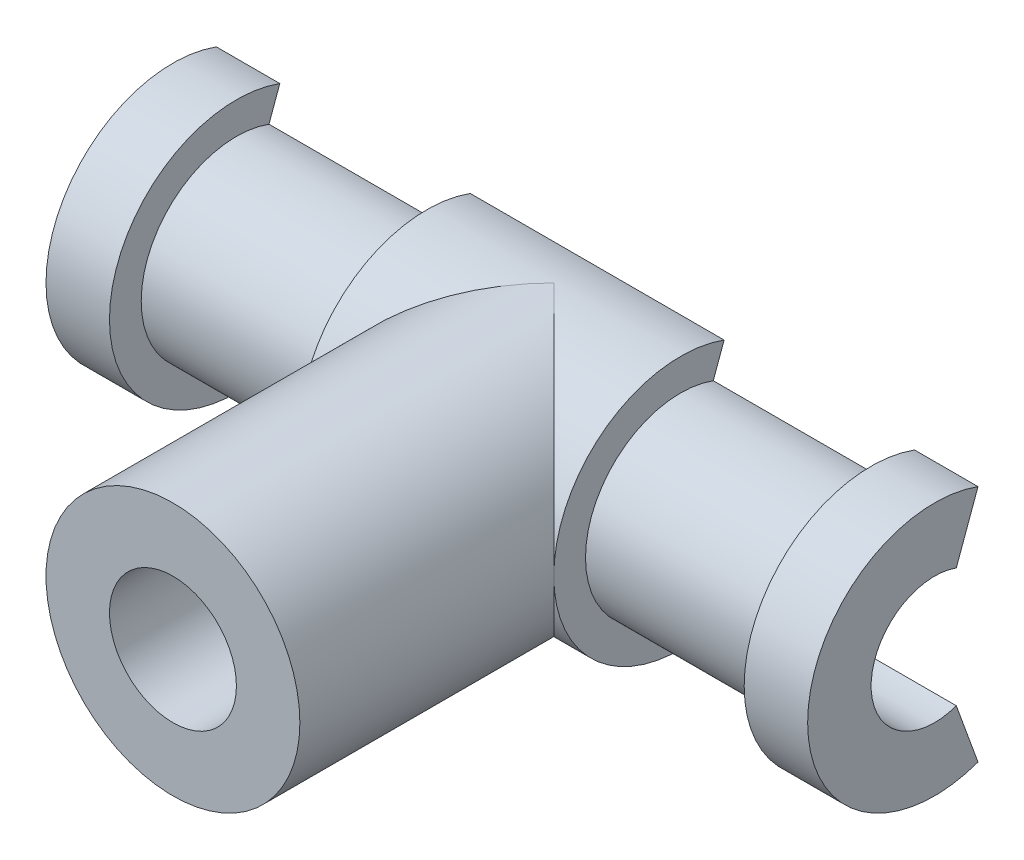
ISO-10303-21;
HEADER;
FILE_DESCRIPTION(('STEP AP214'),'2;1');
FILE_NAME('part.step','',(''),(''),'','','');
FILE_SCHEMA(('AUTOMOTIVE_DESIGN { 1 0 10303 214 1 1 1 1 }'));
ENDSEC;
DATA;
#1=APPLICATION_CONTEXT('core data for automotive mechanical design processes');
#2=APPLICATION_PROTOCOL_DEFINITION('international standard','automotive_design',2000,#1);
#3=PRODUCT_CONTEXT('',#1,'mechanical');
#4=PRODUCT('Part','Part','',(#3));
#5=PRODUCT_RELATED_PRODUCT_CATEGORY('part','',(#4));
#6=PRODUCT_DEFINITION_FORMATION('','',#4);
#7=PRODUCT_DEFINITION_CONTEXT('part definition',#1,'design');
#8=PRODUCT_DEFINITION('design','',#6,#7);
#9=PRODUCT_DEFINITION_SHAPE('','',#8);
#10=(LENGTH_UNIT() NAMED_UNIT(*) SI_UNIT(.MILLI.,.METRE.));
#11=(NAMED_UNIT(*) PLANE_ANGLE_UNIT() SI_UNIT($,.RADIAN.));
#12=(NAMED_UNIT(*) SI_UNIT($,.STERADIAN.) SOLID_ANGLE_UNIT());
#13=UNCERTAINTY_MEASURE_WITH_UNIT(LENGTH_MEASURE(1.E-05),#10,'distance_accuracy_value','');
#14=(GEOMETRIC_REPRESENTATION_CONTEXT(3) GLOBAL_UNCERTAINTY_ASSIGNED_CONTEXT((#13)) GLOBAL_UNIT_ASSIGNED_CONTEXT((#10,
#11,#12)) REPRESENTATION_CONTEXT('',''));
#15=CARTESIAN_POINT('',(0.,0.,0.));
#16=DIRECTION('',(0.,0.,1.));
#17=DIRECTION('',(1.,0.,0.));
#18=AXIS2_PLACEMENT_3D('',#15,#16,#17);
#19=CARTESIAN_POINT('',(9.525,-2.98352407099527,-1.08591395505898));
#20=DIRECTION('',(0.,0.342020143325663,-0.939692620785911));
#21=DIRECTION('',(0.,0.939692620785911,0.342020143325663));
#22=AXIS2_PLACEMENT_3D('',#19,#20,#21);
#23=PLANE('',#22);
#24=DIRECTION('',(-1.,0.,0.));
#25=VECTOR('',#24,1.);
#26=CARTESIAN_POINT('',(9.525,-2.98352407099527,-1.08591395505898));
#27=LINE('',#26,#25);
#28=CARTESIAN_POINT('',(9.525,-2.98352407099527,-1.08591395505898));
#29=VERTEX_POINT('',#28);
#30=CARTESIAN_POINT('',(7.9375,-2.98352407099527,-1.08591395505898));
#31=VERTEX_POINT('',#30);
#32=EDGE_CURVE('E158',#29,#31,#27,.T.);
#33=ORIENTED_EDGE('',*,*,#32,.T.);
#34=DIRECTION('',(0.,0.939692620785911,0.342020143325663));
#35=VECTOR('',#34,1.);
#36=CARTESIAN_POINT('',(7.9375,-2.98352407099527,-1.08591395505898));
#37=LINE('',#36,#35);
#38=CARTESIAN_POINT('',(7.9375,-2.23764305324645,-0.814435466294235));
#39=VERTEX_POINT('',#38);
#40=EDGE_CURVE('E239',#31,#39,#37,.T.);
#41=ORIENTED_EDGE('',*,*,#40,.T.);
#42=DIRECTION('',(-1.,0.,0.));
#43=VECTOR('',#42,1.);
#44=CARTESIAN_POINT('',(7.9375,-2.23764305324645,-0.814435466294236));
#45=LINE('',#44,#43);
#46=CARTESIAN_POINT('',(3.175,-2.23764305324645,-0.814435466294235));
#47=VERTEX_POINT('',#46);
#48=EDGE_CURVE('E234',#47,#39,#45,.F.);
#49=ORIENTED_EDGE('',*,*,#48,.F.);
#50=DIRECTION('',(0.,0.939692620785911,0.342020143325663));
#51=VECTOR('',#50,1.);
#52=CARTESIAN_POINT('',(3.175,-2.98352407099527,-1.08591395505898));
#53=LINE('',#52,#51);
#54=CARTESIAN_POINT('',(3.175,-2.98352407099527,-1.08591395505898));
#55=VERTEX_POINT('',#54);
#56=EDGE_CURVE('E248',#55,#47,#53,.T.);
#57=ORIENTED_EDGE('',*,*,#56,.F.);
#58=CARTESIAN_POINT('',(-3.175,-2.98352407099527,-1.08591395505898));
#59=VERTEX_POINT('',#58);
#60=EDGE_CURVE('E149',#55,#59,#27,.T.);
#61=ORIENTED_EDGE('',*,*,#60,.T.);
#62=DIRECTION('',(0.,-0.939692620785911,-0.342020143325663));
#63=VECTOR('',#62,1.);
#64=CARTESIAN_POINT('',(-3.175,-2.98352407099527,-1.08591395505898));
#65=LINE('',#64,#63);
#66=CARTESIAN_POINT('',(-3.175,-2.23764305324645,-0.814435466294234));
#67=VERTEX_POINT('',#66);
#68=EDGE_CURVE('E264',#67,#59,#65,.T.);
#69=ORIENTED_EDGE('',*,*,#68,.F.);
#70=DIRECTION('',(1.,0.,0.));
#71=VECTOR('',#70,1.);
#72=CARTESIAN_POINT('',(-7.9375,-2.23764305324645,-0.814435466294233));
#73=LINE('',#72,#71);
#74=CARTESIAN_POINT('',(-7.9375,-2.23764305324645,-0.814435466294234));
#75=VERTEX_POINT('',#74);
#76=EDGE_CURVE('E259',#67,#75,#73,.F.);
#77=ORIENTED_EDGE('',*,*,#76,.T.);
#78=DIRECTION('',(0.,-0.939692620785911,-0.342020143325663));
#79=VECTOR('',#78,1.);
#80=CARTESIAN_POINT('',(-7.9375,-2.98352407099527,-1.08591395505898));
#81=LINE('',#80,#79);
#82=CARTESIAN_POINT('',(-7.9375,-2.98352407099527,-1.08591395505898));
#83=VERTEX_POINT('',#82);
#84=EDGE_CURVE('E267',#75,#83,#81,.T.);
#85=ORIENTED_EDGE('',*,*,#84,.T.);
#86=CARTESIAN_POINT('',(-9.525,-2.98352407099527,-1.08591395505898));
#87=VERTEX_POINT('',#86);
#88=EDGE_CURVE('E295',#83,#87,#27,.T.);
#89=ORIENTED_EDGE('',*,*,#88,.T.);
#90=DIRECTION('',(0.,-0.939692620785911,-0.342020143325663));
#91=VECTOR('',#90,1.);
#92=CARTESIAN_POINT('',(-9.525,-2.98352407099527,-1.08591395505898));
#93=LINE('',#92,#91);
#94=CARTESIAN_POINT('',(-9.525,-1.49176203549763,-0.542956977529488));
#95=VERTEX_POINT('',#94);
#96=EDGE_CURVE('E275',#95,#87,#93,.T.);
#97=ORIENTED_EDGE('',*,*,#96,.F.);
#98=DIRECTION('',(-1.,0.,0.));
#99=VECTOR('',#98,1.);
#100=CARTESIAN_POINT('',(9.525,-1.49176203549763,-0.542956977529491));
#101=LINE('',#100,#99);
#102=CARTESIAN_POINT('',(9.525,-1.49176203549763,-0.542956977529491));
#103=VERTEX_POINT('',#102);
#104=EDGE_CURVE('E296',#103,#95,#101,.T.);
#105=ORIENTED_EDGE('',*,*,#104,.F.);
#106=DIRECTION('',(0.,-0.939692620785911,-0.342020143325663));
#107=VECTOR('',#106,1.);
#108=CARTESIAN_POINT('',(9.525,-2.98352407099527,-1.08591395505898));
#109=LINE('',#108,#107);
#110=EDGE_CURVE('E281',#103,#29,#109,.T.);
#111=ORIENTED_EDGE('',*,*,#110,.T.);
#112=EDGE_LOOP('',(#33,#41,#49,#57,#61,#69,#77,#85,#89,#97,#105,#111));
#113=FACE_BOUND('',#112,.T.);
#114=ADVANCED_FACE('F33',(#113),#23,.T.);
#115=CARTESIAN_POINT('',(9.525,1.49176203549763,-0.542956977529502));
#116=DIRECTION('',(0.,-0.342020143325669,-0.939692620785908));
#117=DIRECTION('',(0.,0.939692620785908,-0.342020143325669));
#118=AXIS2_PLACEMENT_3D('',#115,#116,#117);
#119=PLANE('',#118);
#120=DIRECTION('',(-1.,0.,0.));
#121=VECTOR('',#120,1.);
#122=CARTESIAN_POINT('',(7.9375,2.23764305324644,-0.814435466294252));
#123=LINE('',#122,#121);
#124=CARTESIAN_POINT('',(7.9375,2.23764305324644,-0.814435466294251));
#125=VERTEX_POINT('',#124);
#126=CARTESIAN_POINT('',(3.175,2.23764305324644,-0.814435466294251));
#127=VERTEX_POINT('',#126);
#128=EDGE_CURVE('E11',#125,#127,#123,.T.);
#129=ORIENTED_EDGE('',*,*,#128,.F.);
#130=DIRECTION('',(0.,0.939692620785908,-0.342020143325669));
#131=VECTOR('',#130,1.);
#132=CARTESIAN_POINT('',(7.9375,1.49176203549763,-0.542956977529502));
#133=LINE('',#132,#131);
#134=CARTESIAN_POINT('',(7.9375,2.98352407099526,-1.085913955059));
#135=VERTEX_POINT('',#134);
#136=EDGE_CURVE('E243',#125,#135,#133,.T.);
#137=ORIENTED_EDGE('',*,*,#136,.T.);
#138=DIRECTION('',(-1.,0.,0.));
#139=VECTOR('',#138,1.);
#140=CARTESIAN_POINT('',(9.525,2.98352407099526,-1.085913955059));
#141=LINE('',#140,#139);
#142=CARTESIAN_POINT('',(9.525,2.98352407099526,-1.085913955059));
#143=VERTEX_POINT('',#142);
#144=EDGE_CURVE('E163',#143,#135,#141,.T.);
#145=ORIENTED_EDGE('',*,*,#144,.F.);
#146=DIRECTION('',(0.,-0.939692620785908,0.342020143325669));
#147=VECTOR('',#146,1.);
#148=CARTESIAN_POINT('',(9.525,1.49176203549763,-0.542956977529502));
#149=LINE('',#148,#147);
#150=CARTESIAN_POINT('',(9.525,1.49176203549763,-0.542956977529502));
#151=VERTEX_POINT('',#150);
#152=EDGE_CURVE('E274',#143,#151,#149,.T.);
#153=ORIENTED_EDGE('',*,*,#152,.T.);
#154=DIRECTION('',(-1.,0.,0.));
#155=VECTOR('',#154,1.);
#156=CARTESIAN_POINT('',(9.525,1.49176203549763,-0.542956977529502));
#157=LINE('',#156,#155);
#158=CARTESIAN_POINT('',(-9.525,1.49176203549763,-0.542956977529499));
#159=VERTEX_POINT('',#158);
#160=EDGE_CURVE('E297',#151,#159,#157,.T.);
#161=ORIENTED_EDGE('',*,*,#160,.T.);
#162=DIRECTION('',(0.,-0.939692620785908,0.342020143325669));
#163=VECTOR('',#162,1.);
#164=CARTESIAN_POINT('',(-9.525,1.49176203549763,-0.542956977529499));
#165=LINE('',#164,#163);
#166=CARTESIAN_POINT('',(-9.525,2.98352407099526,-1.085913955059));
#167=VERTEX_POINT('',#166);
#168=EDGE_CURVE('E286',#167,#159,#165,.T.);
#169=ORIENTED_EDGE('',*,*,#168,.F.);
#170=CARTESIAN_POINT('',(-7.9375,2.98352407099526,-1.085913955059));
#171=VERTEX_POINT('',#170);
#172=EDGE_CURVE('E283',#171,#167,#141,.T.);
#173=ORIENTED_EDGE('',*,*,#172,.F.);
#174=DIRECTION('',(0.,-0.939692620785908,0.342020143325669));
#175=VECTOR('',#174,1.);
#176=CARTESIAN_POINT('',(-7.9375,1.49176203549763,-0.542956977529499));
#177=LINE('',#176,#175);
#178=CARTESIAN_POINT('',(-7.9375,2.23764305324644,-0.814435466294249));
#179=VERTEX_POINT('',#178);
#180=EDGE_CURVE('E150',#171,#179,#177,.T.);
#181=ORIENTED_EDGE('',*,*,#180,.T.);
#182=DIRECTION('',(1.,0.,0.));
#183=VECTOR('',#182,1.);
#184=CARTESIAN_POINT('',(-7.9375,2.23764305324644,-0.814435466294249));
#185=LINE('',#184,#183);
#186=CARTESIAN_POINT('',(-3.175,2.23764305324644,-0.81443546629425));
#187=VERTEX_POINT('',#186);
#188=EDGE_CURVE('E179',#179,#187,#185,.T.);
#189=ORIENTED_EDGE('',*,*,#188,.T.);
#190=DIRECTION('',(0.,-0.939692620785908,0.342020143325669));
#191=VECTOR('',#190,1.);
#192=CARTESIAN_POINT('',(-3.175,1.49176203549763,-0.5429569775295));
#193=LINE('',#192,#191);
#194=CARTESIAN_POINT('',(-3.175,2.98352407099526,-1.085913955059));
#195=VERTEX_POINT('',#194);
#196=EDGE_CURVE('E314',#195,#187,#193,.T.);
#197=ORIENTED_EDGE('',*,*,#196,.F.);
#198=CARTESIAN_POINT('',(3.175,2.98352407099526,-1.085913955059));
#199=VERTEX_POINT('',#198);
#200=EDGE_CURVE('E301',#199,#195,#141,.T.);
#201=ORIENTED_EDGE('',*,*,#200,.F.);
#202=DIRECTION('',(0.,0.939692620785908,-0.342020143325669));
#203=VECTOR('',#202,1.);
#204=CARTESIAN_POINT('',(3.175,1.49176203549763,-0.542956977529501));
#205=LINE('',#204,#203);
#206=EDGE_CURVE('E48',#127,#199,#205,.T.);
#207=ORIENTED_EDGE('',*,*,#206,.F.);
#208=EDGE_LOOP('',(#129,#137,#145,#153,#161,#169,#173,#181,#189,#197,#201,#207));
#209=FACE_BOUND('',#208,.T.);
#210=ADVANCED_FACE('F190',(#209),#119,.T.);
#211=CARTESIAN_POINT('',(9.525,0.,0.));
#212=DIRECTION('',(-1.,0.,0.));
#213=DIRECTION('',(0.,0.,1.));
#214=AXIS2_PLACEMENT_3D('',#211,#212,#213);
#215=CYLINDRICAL_SURFACE('',#214,3.175);
#216=ORIENTED_EDGE('',*,*,#144,.T.);
#217=CARTESIAN_POINT('',(7.9375,0.,0.));
#218=DIRECTION('',(1.,0.,0.));
#219=DIRECTION('',(0.,0.,-1.));
#220=AXIS2_PLACEMENT_3D('',#217,#218,#219);
#221=CIRCLE('',#220,3.175);
#222=EDGE_CURVE('E138',#135,#31,#221,.T.);
#223=ORIENTED_EDGE('',*,*,#222,.T.);
#224=ORIENTED_EDGE('',*,*,#32,.F.);
#225=CARTESIAN_POINT('',(9.525,0.,0.));
#226=DIRECTION('',(-1.,0.,0.));
#227=DIRECTION('',(0.,0.,-1.));
#228=AXIS2_PLACEMENT_3D('',#225,#226,#227);
#229=CIRCLE('',#228,3.175);
#230=EDGE_CURVE('E271',#29,#143,#229,.T.);
#231=ORIENTED_EDGE('',*,*,#230,.T.);
#232=EDGE_LOOP('',(#216,#223,#224,#231));
#233=FACE_BOUND('',#232,.T.);
#234=ADVANCED_FACE('F189',(#233),#215,.T.);
#235=CARTESIAN_POINT('',(3.175,0.,0.));
#236=DIRECTION('',(-1.,0.,0.));
#237=DIRECTION('',(0.,0.,1.));
#238=AXIS2_PLACEMENT_3D('',#235,#236,#237);
#239=CIRCLE('',#238,3.175);
#240=CARTESIAN_POINT('',(3.175,0.,3.175));
#241=VERTEX_POINT('',#240);
#242=EDGE_CURVE('E41',#241,#55,#239,.F.);
#243=ORIENTED_EDGE('',*,*,#242,.F.);
#244=CARTESIAN_POINT('',(0.,0.,0.));
#245=DIRECTION('',(0.707106781186547,0.,-0.707106781186548));
#246=DIRECTION('',(-0.707106781186548,0.,-0.707106781186547));
#247=AXIS2_PLACEMENT_3D('',#244,#245,#246);
#248=ELLIPSE('',#247,4.49012806053458,3.175);
#249=CARTESIAN_POINT('',(0.,-3.175,0.));
#250=VERTEX_POINT('',#249);
#251=EDGE_CURVE('E147',#250,#241,#248,.F.);
#252=ORIENTED_EDGE('',*,*,#251,.F.);
#253=CARTESIAN_POINT('',(0.,0.,0.));
#254=DIRECTION('',(-0.707106781186548,0.,-0.707106781186547));
#255=DIRECTION('',(0.707106781186547,0.,-0.707106781186548));
#256=AXIS2_PLACEMENT_3D('',#253,#254,#255);
#257=ELLIPSE('',#256,4.49012806053458,3.175);
#258=CARTESIAN_POINT('',(-3.175,0.,3.175));
#259=VERTEX_POINT('',#258);
#260=EDGE_CURVE('E160',#259,#250,#257,.F.);
#261=ORIENTED_EDGE('',*,*,#260,.F.);
#262=CARTESIAN_POINT('',(-3.175,0.,0.));
#263=DIRECTION('',(1.,0.,0.));
#264=DIRECTION('',(0.,0.,-1.));
#265=AXIS2_PLACEMENT_3D('',#262,#263,#264);
#266=CIRCLE('',#265,3.175);
#267=EDGE_CURVE('E255',#259,#59,#266,.T.);
#268=ORIENTED_EDGE('',*,*,#267,.T.);
#269=ORIENTED_EDGE('',*,*,#60,.F.);
#270=EDGE_LOOP('',(#243,#252,#261,#268,#269));
#271=FACE_BOUND('',#270,.T.);
#272=ADVANCED_FACE('F144',(#271),#215,.T.);
#273=ORIENTED_EDGE('',*,*,#88,.F.);
#274=CARTESIAN_POINT('',(-7.9375,0.,0.));
#275=DIRECTION('',(1.,0.,0.));
#276=DIRECTION('',(0.,0.,-1.));
#277=AXIS2_PLACEMENT_3D('',#274,#275,#276);
#278=CIRCLE('',#277,3.175);
#279=EDGE_CURVE('E257',#171,#83,#278,.T.);
#280=ORIENTED_EDGE('',*,*,#279,.F.);
#281=ORIENTED_EDGE('',*,*,#172,.T.);
#282=CARTESIAN_POINT('',(-9.525,0.,0.));
#283=DIRECTION('',(-1.,0.,0.));
#284=DIRECTION('',(0.,0.,-1.));
#285=AXIS2_PLACEMENT_3D('',#282,#283,#284);
#286=CIRCLE('',#285,3.175);
#287=EDGE_CURVE('E270',#87,#167,#286,.T.);
#288=ORIENTED_EDGE('',*,*,#287,.F.);
#289=EDGE_LOOP('',(#273,#280,#281,#288));
#290=FACE_BOUND('',#289,.T.);
#291=ADVANCED_FACE('F308',(#290),#215,.T.);
#292=CARTESIAN_POINT('',(0.,0.,9.525));
#293=DIRECTION('',(0.,0.,-1.));
#294=DIRECTION('',(-1.,0.,0.));
#295=AXIS2_PLACEMENT_3D('',#292,#293,#294);
#296=CYLINDRICAL_SURFACE('',#295,3.175);
#297=CARTESIAN_POINT('',(0.,0.,9.525));
#298=DIRECTION('',(0.,0.,1.));
#299=DIRECTION('',(1.,0.,0.));
#300=AXIS2_PLACEMENT_3D('',#297,#298,#299);
#301=CIRCLE('',#300,3.175);
#302=CARTESIAN_POINT('',(3.175,0.,9.525));
#303=VERTEX_POINT('',#302);
#304=EDGE_CURVE('E169',#303,#303,#301,.T.);
#305=ORIENTED_EDGE('',*,*,#304,.F.);
#306=EDGE_LOOP('',(#305));
#307=FACE_BOUND('',#306,.T.);
#308=ORIENTED_EDGE('',*,*,#251,.T.);
#309=CARTESIAN_POINT('',(0.,3.175,0.));
#310=VERTEX_POINT('',#309);
#311=EDGE_CURVE('E152',#241,#310,#248,.F.);
#312=ORIENTED_EDGE('',*,*,#311,.T.);
#313=EDGE_CURVE('E156',#310,#259,#257,.F.);
#314=ORIENTED_EDGE('',*,*,#313,.T.);
#315=ORIENTED_EDGE('',*,*,#260,.T.);
#316=EDGE_LOOP('',(#308,#312,#314,#315));
#317=FACE_BOUND('',#316,.T.);
#318=ADVANCED_FACE('F35',(#307,#317),#296,.T.);
#319=CARTESIAN_POINT('',(0.,0.,9.525));
#320=DIRECTION('',(0.,0.,-1.));
#321=DIRECTION('',(-1.,0.,0.));
#322=AXIS2_PLACEMENT_3D('',#319,#320,#321);
#323=CYLINDRICAL_SURFACE('',#322,1.5875);
#324=CARTESIAN_POINT('',(-1.5875,0.,3.175));
#325=CARTESIAN_POINT('',(-1.58749475757146,-0.0834579911850831,3.17499545030503));
#326=CARTESIAN_POINT('',(-1.58088000892032,-0.16701547701988,3.17167404493863));
#327=CARTESIAN_POINT('',(-1.55471355245781,-0.331660873489372,3.15871472708987));
#328=CARTESIAN_POINT('',(-1.53513727611597,-0.412743787657887,3.1490648192841));
#329=CARTESIAN_POINT('',(-1.4840048288211,-0.569807002497712,3.12445843552858));
#330=CARTESIAN_POINT('',(-1.45249521500635,-0.645805799665895,3.10952259694341));
#331=CARTESIAN_POINT('',(-1.37863163858309,-0.791325279180475,3.07571420218771));
#332=CARTESIAN_POINT('',(-1.33627853100493,-0.860846471709218,3.05684195643221));
#333=CARTESIAN_POINT('',(-1.23901636644211,-0.996168660697031,3.01555559984673));
#334=CARTESIAN_POINT('',(-1.18350271420707,-1.06149014765635,2.99299628614965));
#335=CARTESIAN_POINT('',(-1.06279715169533,-1.18233736872633,2.94735202766705));
#336=CARTESIAN_POINT('',(-0.99759793531125,-1.23785563818199,2.92426669731842));
#337=CARTESIAN_POINT('',(-0.853307682631633,-1.34183755071482,2.87812085025789));
#338=CARTESIAN_POINT('',(-0.773531443875864,-1.38942022018822,2.85520109315084));
#339=CARTESIAN_POINT('',(-0.605841854121884,-1.47029206018898,2.81441491301059));
#340=CARTESIAN_POINT('',(-0.517934370652636,-1.50359144125905,2.79654488326096));
#341=CARTESIAN_POINT('',(-0.341844145142699,-1.55278525197438,2.76951863922521));
#342=CARTESIAN_POINT('',(-0.253992932343013,-1.5696022981152,2.75990481139145));
#343=CARTESIAN_POINT('',(-0.0762335950250813,-1.58817785187779,2.74926250293288));
#344=CARTESIAN_POINT('',(0.0136724086329573,-1.58995124029226,2.7482255383247));
#345=CARTESIAN_POINT('',(0.181429063600646,-1.57906606838602,2.75448601783382));
#346=CARTESIAN_POINT('',(0.259435649566591,-1.5681079882647,2.76080162313446));
#347=CARTESIAN_POINT('',(0.412308531129703,-1.53501701037788,2.77933513114987));
#348=CARTESIAN_POINT('',(0.487173818172188,-1.51288055293752,2.79155491395445));
#349=CARTESIAN_POINT('',(0.633776247947983,-1.45765802636278,2.82078868805226));
#350=CARTESIAN_POINT('',(0.705399908072439,-1.42432891904664,2.83790772054098));
#351=CARTESIAN_POINT('',(0.842381939486637,-1.34785367917295,2.87501654296728));
#352=CARTESIAN_POINT('',(0.907737477765141,-1.30470313705229,2.89500762088552));
#353=CARTESIAN_POINT('',(1.03905248872987,-1.20342986217405,2.93867138171466));
#354=CARTESIAN_POINT('',(1.10403778680215,-1.14410245266123,2.96248947500834));
#355=CARTESIAN_POINT('',(1.22354247701306,-1.01529448125193,3.00906851989396));
#356=CARTESIAN_POINT('',(1.27805686735379,-0.945809094811678,3.03182896234596));
#357=CARTESIAN_POINT('',(1.37745098688469,-0.794569953008059,3.07501904811705));
#358=CARTESIAN_POINT('',(1.42176575000761,-0.712396326664061,3.09529137357186));
#359=CARTESIAN_POINT('',(1.49557903360578,-0.540490117088465,3.12988136279972));
#360=CARTESIAN_POINT('',(1.52508931871158,-0.450763602321125,3.14420375322891));
#361=CARTESIAN_POINT('',(1.56602970340022,-0.274266805511365,3.16427379814529));
#362=CARTESIAN_POINT('',(1.57875483674802,-0.187867179745468,3.1706333955333));
#363=CARTESIAN_POINT('',(1.589825260676,-0.0139376149195955,3.17615908866327));
#364=CARTESIAN_POINT('',(1.58817736345266,0.0735917690434801,3.17532859220093));
#365=CARTESIAN_POINT('',(1.57129688213524,0.240082343027754,3.16692267702328));
#366=CARTESIAN_POINT('',(1.55712710429113,0.319181810279264,3.15987502529967));
#367=CARTESIAN_POINT('',(1.51727206086649,0.473720941529331,3.14042696962309));
#368=CARTESIAN_POINT('',(1.49158552575508,0.5491602010346,3.12802597555879));
#369=CARTESIAN_POINT('',(1.42875243453756,0.696735665913696,3.09854999119071));
#370=CARTESIAN_POINT('',(1.39129920794039,0.768715755246712,3.08135149809289));
#371=CARTESIAN_POINT('',(1.30634178716107,0.905607411697593,3.043935592289));
#372=CARTESIAN_POINT('',(1.25883331132981,0.970515949770338,3.02371689462514));
#373=CARTESIAN_POINT('',(1.14973032478749,1.09818120674663,2.97986801371214));
#374=CARTESIAN_POINT('',(1.08721069634333,1.1601006735377,2.95609779689055));
#375=CARTESIAN_POINT('',(0.952618822346608,1.27294690977618,2.90929046679002));
#376=CARTESIAN_POINT('',(0.880540023828928,1.3238660748176,2.88625386997575));
#377=CARTESIAN_POINT('',(0.724465699000401,1.41558631423544,2.84243767627802));
#378=CARTESIAN_POINT('',(0.640062115075011,1.45577797458289,2.82182140722634));
#379=CARTESIAN_POINT('',(0.464327767724742,1.52095648617134,2.78723839766939));
#380=CARTESIAN_POINT('',(0.373006101733812,1.54596292893889,2.77326309427028));
#381=CARTESIAN_POINT('',(0.195405021170532,1.57775542885366,2.75528882878461));
#382=CARTESIAN_POINT('',(0.109483122671554,1.58606013179365,2.75046096250791));
#383=CARTESIAN_POINT('',(-0.0626222191236835,1.58859403257222,2.74900000493545));
#384=CARTESIAN_POINT('',(-0.148805532871356,1.5828293315144,2.75236336156894));
#385=CARTESIAN_POINT('',(-0.310330058684332,1.55880772437938,2.76602606006084));
#386=CARTESIAN_POINT('',(-0.385921996354775,1.54179319901957,2.7756341249122));
#387=CARTESIAN_POINT('',(-0.533095389586183,1.49729088118125,2.79988988197899));
#388=CARTESIAN_POINT('',(-0.604675546571101,1.46979971971638,2.81453919516849));
#389=CARTESIAN_POINT('',(-0.747116950941128,1.40305749566465,2.848427919537));
#390=CARTESIAN_POINT('',(-0.817606794153584,1.36314043128242,2.86790959303524));
#391=CARTESIAN_POINT('',(-0.951348326187749,1.27341466747436,2.90886088970341));
#392=CARTESIAN_POINT('',(-1.01459622220227,1.22360082184598,2.93033154400532));
#393=CARTESIAN_POINT('',(-1.14005039698805,1.10839778107493,2.97596438013471));
#394=CARTESIAN_POINT('',(-1.20119632498109,1.04185152150815,3.00013660999272));
#395=CARTESIAN_POINT('',(-1.31169248620349,0.898770754895199,3.0460593171264));
#396=CARTESIAN_POINT('',(-1.36103636140848,0.822230898247,3.06780848569085));
#397=CARTESIAN_POINT('',(-1.44658772580541,0.660291409892926,3.10670590186878));
#398=CARTESIAN_POINT('',(-1.48269986866289,0.574832962245559,3.12382053184118));
#399=CARTESIAN_POINT('',(-1.53957046631489,0.398053085556712,3.15120879312142));
#400=CARTESIAN_POINT('',(-1.56037255680407,0.306749131847695,3.1615018583887));
#401=CARTESIAN_POINT('',(-1.57781214009861,0.178755590054295,3.17016545787646));
#402=CARTESIAN_POINT('',(-1.58143994237532,0.143131983613483,3.17197367477648));
#403=CARTESIAN_POINT('',(-1.58628503150361,0.071678374240582,3.17439193950695));
#404=CARTESIAN_POINT('',(-1.58750225182146,0.0358483656390222,3.17500195426617));
#405=CARTESIAN_POINT('',(-1.5875,0.,3.175));
#406=B_SPLINE_CURVE_WITH_KNOTS('',3,(#324,#325,#326,#327,#328,#329,#330,#331,#332,#333,#334,
#335,#336,#337,#338,#339,#340,#341,#342,#343,#344,#345,#346,#347,#348,#349,#350,#351,#352,#353,
#354,#355,#356,#357,#358,#359,#360,#361,#362,#363,#364,#365,#366,#367,#368,#369,#370,#371,#372,
#373,#374,#375,#376,#377,#378,#379,#380,#381,#382,#383,#384,#385,#386,#387,#388,#389,#390,#391,
#392,#393,#394,#395,#396,#397,#398,#399,#400,#401,#402,#403,#404,#405),.UNSPECIFIED.,.T.,.F.,(4,
2,2,2,2,2,2,2,2,2,2,2,2,2,2,2,2,2,2,2,2,2,2,2,2,2,2,2,2,2,2,2,2,2,2,2,2,2,2,2,4),(0.,
0.250228508654714,0.500932687663351,0.750668671844023,1.00038496992324,1.26520854196497,
1.53023290227578,1.8158099070882,2.10118242288521,2.36947094272614,2.6374940475982,
2.87346568449796,3.10951251232014,3.35105756267474,3.59271127500602,3.86500594367532,
4.13743036175415,4.42250547765424,4.70735369348244,4.96860973623261,5.22974196161968,
5.47063464078469,5.71155388089104,5.95936158944289,6.20727503062988,6.47953381898015,
6.75198021926998,7.03762057931739,7.32289162713403,7.58077775661086,7.83855207535177,
8.07176964270058,8.30506226951507,8.55402875138706,8.80312503315514,9.0824882287701,
9.36200158617727,9.64349121690848,9.92417542436074,10.0316550721259,10.1391376863632),.UNSPECIFIED.);
#407=CARTESIAN_POINT('',(-1.5875,0.,3.175));
#408=VERTEX_POINT('',#407);
#409=EDGE_CURVE('E172',#408,#408,#406,.T.);
#410=ORIENTED_EDGE('',*,*,#409,.F.);
#411=EDGE_LOOP('',(#410));
#412=FACE_BOUND('',#411,.T.);
#413=CARTESIAN_POINT('',(0.,0.,9.525));
#414=DIRECTION('',(0.,0.,1.));
#415=DIRECTION('',(1.,0.,0.));
#416=AXIS2_PLACEMENT_3D('',#413,#414,#415);
#417=CIRCLE('',#416,1.5875);
#418=CARTESIAN_POINT('',(1.5875,0.,9.525));
#419=VERTEX_POINT('',#418);
#420=EDGE_CURVE('E166',#419,#419,#417,.T.);
#421=ORIENTED_EDGE('',*,*,#420,.T.);
#422=EDGE_LOOP('',(#421));
#423=FACE_BOUND('',#422,.T.);
#424=ADVANCED_FACE('F181',(#412,#423),#323,.F.);
#425=CARTESIAN_POINT('',(0.,0.,9.525));
#426=DIRECTION('',(0.,0.,1.));
#427=DIRECTION('',(1.,0.,0.));
#428=AXIS2_PLACEMENT_3D('',#425,#426,#427);
#429=PLANE('',#428);
#430=ORIENTED_EDGE('',*,*,#304,.T.);
#431=EDGE_LOOP('',(#430));
#432=FACE_BOUND('',#431,.T.);
#433=ORIENTED_EDGE('',*,*,#420,.F.);
#434=EDGE_LOOP('',(#433));
#435=FACE_BOUND('',#434,.T.);
#436=ADVANCED_FACE('F187',(#432,#435),#429,.T.);
#437=ORIENTED_EDGE('',*,*,#409,.T.);
#438=EDGE_LOOP('',(#437));
#439=FACE_BOUND('',#438,.T.);
#440=ADVANCED_FACE('F183',(#439),#215,.T.);
#441=CARTESIAN_POINT('',(3.175,0.,0.));
#442=DIRECTION('',(1.,0.,0.));
#443=DIRECTION('',(0.,0.,-1.));
#444=AXIS2_PLACEMENT_3D('',#441,#442,#443);
#445=CIRCLE('',#444,3.175);
#446=EDGE_CURVE('E131',#199,#241,#445,.T.);
#447=ORIENTED_EDGE('',*,*,#446,.F.);
#448=ORIENTED_EDGE('',*,*,#200,.T.);
#449=EDGE_CURVE('E260',#195,#259,#266,.T.);
#450=ORIENTED_EDGE('',*,*,#449,.T.);
#451=ORIENTED_EDGE('',*,*,#313,.F.);
#452=ORIENTED_EDGE('',*,*,#311,.F.);
#453=EDGE_LOOP('',(#447,#448,#450,#451,#452));
#454=FACE_BOUND('',#453,.T.);
#455=ADVANCED_FACE('F153',(#454),#215,.T.);
#456=CARTESIAN_POINT('',(9.525,0.,0.));
#457=DIRECTION('',(-1.,0.,0.));
#458=DIRECTION('',(0.,0.,1.));
#459=AXIS2_PLACEMENT_3D('',#456,#457,#458);
#460=CYLINDRICAL_SURFACE('',#459,1.5875);
#461=CARTESIAN_POINT('',(-9.525,0.,0.));
#462=DIRECTION('',(1.,0.,0.));
#463=DIRECTION('',(0.,0.,1.));
#464=AXIS2_PLACEMENT_3D('',#461,#462,#463);
#465=CIRCLE('',#464,1.5875);
#466=EDGE_CURVE('E289',#159,#95,#465,.T.);
#467=ORIENTED_EDGE('',*,*,#466,.F.);
#468=ORIENTED_EDGE('',*,*,#160,.F.);
#469=CARTESIAN_POINT('',(9.525,0.,0.));
#470=DIRECTION('',(1.,0.,0.));
#471=DIRECTION('',(0.,0.,1.));
#472=AXIS2_PLACEMENT_3D('',#469,#470,#471);
#473=CIRCLE('',#472,1.5875);
#474=EDGE_CURVE('E278',#151,#103,#473,.T.);
#475=ORIENTED_EDGE('',*,*,#474,.T.);
#476=ORIENTED_EDGE('',*,*,#104,.T.);
#477=EDGE_LOOP('',(#467,#468,#475,#476));
#478=FACE_BOUND('',#477,.T.);
#479=ADVANCED_FACE('F194',(#478),#460,.F.);
#480=CARTESIAN_POINT('',(9.525,0.,0.));
#481=DIRECTION('',(1.,0.,0.));
#482=DIRECTION('',(0.,0.,-1.));
#483=AXIS2_PLACEMENT_3D('',#480,#481,#482);
#484=PLANE('',#483);
#485=ORIENTED_EDGE('',*,*,#230,.F.);
#486=ORIENTED_EDGE('',*,*,#110,.F.);
#487=ORIENTED_EDGE('',*,*,#474,.F.);
#488=ORIENTED_EDGE('',*,*,#152,.F.);
#489=EDGE_LOOP('',(#485,#486,#487,#488));
#490=FACE_BOUND('',#489,.T.);
#491=ADVANCED_FACE('F197',(#490),#484,.T.);
#492=CARTESIAN_POINT('',(-9.525,0.,0.));
#493=DIRECTION('',(1.,0.,0.));
#494=DIRECTION('',(0.,0.,-1.));
#495=AXIS2_PLACEMENT_3D('',#492,#493,#494);
#496=PLANE('',#495);
#497=ORIENTED_EDGE('',*,*,#287,.T.);
#498=ORIENTED_EDGE('',*,*,#168,.T.);
#499=ORIENTED_EDGE('',*,*,#466,.T.);
#500=ORIENTED_EDGE('',*,*,#96,.T.);
#501=EDGE_LOOP('',(#497,#498,#499,#500));
#502=FACE_BOUND('',#501,.T.);
#503=ADVANCED_FACE('F202',(#502),#496,.F.);
#504=CARTESIAN_POINT('',(-7.9375,0.,0.));
#505=DIRECTION('',(1.,0.,0.));
#506=DIRECTION('',(0.,0.,-1.));
#507=AXIS2_PLACEMENT_3D('',#504,#505,#506);
#508=PLANE('',#507);
#509=CARTESIAN_POINT('',(-7.9375,0.,0.));
#510=DIRECTION('',(1.,0.,0.));
#511=DIRECTION('',(0.,0.,-1.));
#512=AXIS2_PLACEMENT_3D('',#509,#510,#511);
#513=CIRCLE('',#512,2.38125);
#514=EDGE_CURVE('E252',#179,#75,#513,.T.);
#515=ORIENTED_EDGE('',*,*,#514,.F.);
#516=ORIENTED_EDGE('',*,*,#180,.F.);
#517=ORIENTED_EDGE('',*,*,#279,.T.);
#518=ORIENTED_EDGE('',*,*,#84,.F.);
#519=EDGE_LOOP('',(#515,#516,#517,#518));
#520=FACE_BOUND('',#519,.T.);
#521=ADVANCED_FACE('F205',(#520),#508,.T.);
#522=CARTESIAN_POINT('',(-3.175,0.,0.));
#523=DIRECTION('',(1.,0.,0.));
#524=DIRECTION('',(0.,0.,-1.));
#525=AXIS2_PLACEMENT_3D('',#522,#523,#524);
#526=PLANE('',#525);
#527=ORIENTED_EDGE('',*,*,#68,.T.);
#528=ORIENTED_EDGE('',*,*,#267,.F.);
#529=ORIENTED_EDGE('',*,*,#449,.F.);
#530=ORIENTED_EDGE('',*,*,#196,.T.);
#531=CARTESIAN_POINT('',(-3.175,0.,0.));
#532=DIRECTION('',(1.,0.,0.));
#533=DIRECTION('',(0.,0.,-1.));
#534=AXIS2_PLACEMENT_3D('',#531,#532,#533);
#535=CIRCLE('',#534,2.38125);
#536=EDGE_CURVE('E56',#187,#67,#535,.T.);
#537=ORIENTED_EDGE('',*,*,#536,.T.);
#538=EDGE_LOOP('',(#527,#528,#529,#530,#537));
#539=FACE_BOUND('',#538,.T.);
#540=ADVANCED_FACE('F210',(#539),#526,.F.);
#541=CARTESIAN_POINT('',(-7.9375,0.,0.));
#542=DIRECTION('',(1.,0.,0.));
#543=DIRECTION('',(0.,0.,-1.));
#544=AXIS2_PLACEMENT_3D('',#541,#542,#543);
#545=CYLINDRICAL_SURFACE('',#544,2.38125);
#546=ORIENTED_EDGE('',*,*,#536,.F.);
#547=ORIENTED_EDGE('',*,*,#188,.F.);
#548=ORIENTED_EDGE('',*,*,#514,.T.);
#549=ORIENTED_EDGE('',*,*,#76,.F.);
#550=EDGE_LOOP('',(#546,#547,#548,#549));
#551=FACE_BOUND('',#550,.T.);
#552=ADVANCED_FACE('F213',(#551),#545,.T.);
#553=CARTESIAN_POINT('',(7.9375,0.,0.));
#554=DIRECTION('',(-1.,0.,0.));
#555=DIRECTION('',(0.,0.,-1.));
#556=AXIS2_PLACEMENT_3D('',#553,#554,#555);
#557=PLANE('',#556);
#558=ORIENTED_EDGE('',*,*,#222,.F.);
#559=ORIENTED_EDGE('',*,*,#136,.F.);
#560=CARTESIAN_POINT('',(7.9375,0.,0.));
#561=DIRECTION('',(1.,0.,0.));
#562=DIRECTION('',(0.,0.,-1.));
#563=AXIS2_PLACEMENT_3D('',#560,#561,#562);
#564=CIRCLE('',#563,2.38125);
#565=EDGE_CURVE('E139',#125,#39,#564,.T.);
#566=ORIENTED_EDGE('',*,*,#565,.T.);
#567=ORIENTED_EDGE('',*,*,#40,.F.);
#568=EDGE_LOOP('',(#558,#559,#566,#567));
#569=FACE_BOUND('',#568,.T.);
#570=ADVANCED_FACE('F220',(#569),#557,.T.);
#571=CARTESIAN_POINT('',(3.175,0.,0.));
#572=DIRECTION('',(-1.,0.,0.));
#573=DIRECTION('',(0.,0.,-1.));
#574=AXIS2_PLACEMENT_3D('',#571,#572,#573);
#575=PLANE('',#574);
#576=ORIENTED_EDGE('',*,*,#56,.T.);
#577=CARTESIAN_POINT('',(3.175,0.,0.));
#578=DIRECTION('',(1.,0.,0.));
#579=DIRECTION('',(0.,0.,-1.));
#580=AXIS2_PLACEMENT_3D('',#577,#578,#579);
#581=CIRCLE('',#580,2.38125);
#582=EDGE_CURVE('E237',#127,#47,#581,.T.);
#583=ORIENTED_EDGE('',*,*,#582,.F.);
#584=ORIENTED_EDGE('',*,*,#206,.T.);
#585=ORIENTED_EDGE('',*,*,#446,.T.);
#586=ORIENTED_EDGE('',*,*,#242,.T.);
#587=EDGE_LOOP('',(#576,#583,#584,#585,#586));
#588=FACE_BOUND('',#587,.T.);
#589=ADVANCED_FACE('F133',(#588),#575,.F.);
#590=CARTESIAN_POINT('',(7.9375,0.,0.));
#591=DIRECTION('',(-1.,0.,0.));
#592=DIRECTION('',(0.,0.,1.));
#593=AXIS2_PLACEMENT_3D('',#590,#591,#592);
#594=CYLINDRICAL_SURFACE('',#593,2.38125);
#595=ORIENTED_EDGE('',*,*,#48,.T.);
#596=ORIENTED_EDGE('',*,*,#565,.F.);
#597=ORIENTED_EDGE('',*,*,#128,.T.);
#598=ORIENTED_EDGE('',*,*,#582,.T.);
#599=EDGE_LOOP('',(#595,#596,#597,#598));
#600=FACE_BOUND('',#599,.T.);
#601=ADVANCED_FACE('F223',(#600),#594,.T.);
#602=CLOSED_SHELL('',(#114,#210,#234,#272,#291,#318,#424,#436,#440,#455,#479,#491,#503,#521,
#540,#552,#570,#589,#601));
#603=MANIFOLD_SOLID_BREP('B2',#602);
#604=ADVANCED_BREP_SHAPE_REPRESENTATION('',(#18,#603),#14);
#605=SHAPE_DEFINITION_REPRESENTATION(#9,#604);
ENDSEC;
END-ISO-10303-21;
